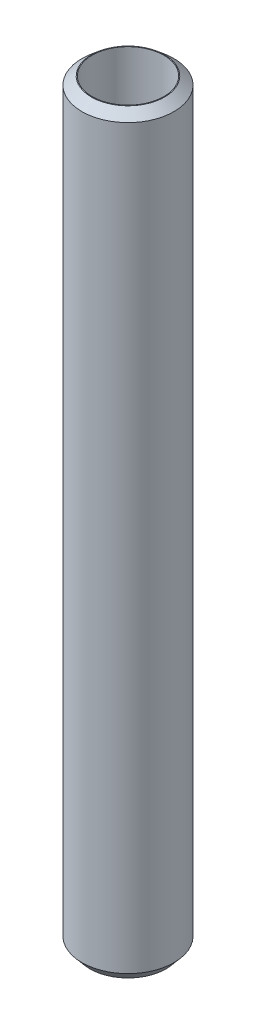
ISO-10303-21;
HEADER;
FILE_DESCRIPTION(('STEP AP214'),'2;1');
FILE_NAME('part.step','',(''),(''),'','','');
FILE_SCHEMA(('AUTOMOTIVE_DESIGN { 1 0 10303 214 1 1 1 1 }'));
ENDSEC;
DATA;
#1=APPLICATION_CONTEXT('core data for automotive mechanical design processes');
#2=APPLICATION_PROTOCOL_DEFINITION('international standard','automotive_design',2000,#1);
#3=PRODUCT_CONTEXT('',#1,'mechanical');
#4=PRODUCT('Part','Part','',(#3));
#5=PRODUCT_RELATED_PRODUCT_CATEGORY('part','',(#4));
#6=PRODUCT_DEFINITION_FORMATION('','',#4);
#7=PRODUCT_DEFINITION_CONTEXT('part definition',#1,'design');
#8=PRODUCT_DEFINITION('design','',#6,#7);
#9=PRODUCT_DEFINITION_SHAPE('','',#8);
#10=(LENGTH_UNIT() NAMED_UNIT(*) SI_UNIT(.MILLI.,.METRE.));
#11=(NAMED_UNIT(*) PLANE_ANGLE_UNIT() SI_UNIT($,.RADIAN.));
#12=(NAMED_UNIT(*) SI_UNIT($,.STERADIAN.) SOLID_ANGLE_UNIT());
#13=UNCERTAINTY_MEASURE_WITH_UNIT(LENGTH_MEASURE(1.E-05),#10,'distance_accuracy_value','');
#14=(GEOMETRIC_REPRESENTATION_CONTEXT(3) GLOBAL_UNCERTAINTY_ASSIGNED_CONTEXT((#13)) GLOBAL_UNIT_ASSIGNED_CONTEXT((#10,
#11,#12)) REPRESENTATION_CONTEXT('',''));
#15=CARTESIAN_POINT('',(0.,0.,0.));
#16=DIRECTION('',(0.,0.,1.));
#17=DIRECTION('',(1.,0.,0.));
#18=AXIS2_PLACEMENT_3D('',#15,#16,#17);
#19=CARTESIAN_POINT('',(0.,491.772621860279,0.));
#20=DIRECTION('',(0.,-1.,0.));
#21=DIRECTION('',(0.,0.,-1.));
#22=AXIS2_PLACEMENT_3D('',#19,#20,#21);
#23=CYLINDRICAL_SURFACE('',#22,30.);
#24=CARTESIAN_POINT('',(0.,486.602276129067,0.));
#25=DIRECTION('',(0.,1.,0.));
#26=DIRECTION('',(0.,0.,1.));
#27=AXIS2_PLACEMENT_3D('',#24,#25,#26);
#28=CIRCLE('',#27,30.);
#29=CARTESIAN_POINT('',(0.,486.602276129067,30.));
#30=VERTEX_POINT('',#29);
#31=EDGE_CURVE('E50',#30,#30,#28,.F.);
#32=ORIENTED_EDGE('',*,*,#31,.T.);
#33=EDGE_LOOP('',(#32));
#34=FACE_BOUND('',#33,.T.);
#35=CARTESIAN_POINT('',(0.,6.11550120719406,0.));
#36=DIRECTION('',(0.,1.,0.));
#37=DIRECTION('',(0.,0.,1.));
#38=AXIS2_PLACEMENT_3D('',#35,#36,#37);
#39=CIRCLE('',#38,30.);
#40=CARTESIAN_POINT('',(0.,6.11550120719406,30.));
#41=VERTEX_POINT('',#40);
#42=EDGE_CURVE('E51',#41,#41,#39,.T.);
#43=ORIENTED_EDGE('',*,*,#42,.T.);
#44=EDGE_LOOP('',(#43));
#45=FACE_BOUND('',#44,.T.);
#46=ADVANCED_FACE('F39',(#34,#45),#23,.T.);
#47=CARTESIAN_POINT('',(0.,491.772621860279,0.));
#48=DIRECTION('',(0.,1.,0.));
#49=DIRECTION('',(0.,0.,1.));
#50=AXIS2_PLACEMENT_3D('',#47,#48,#49);
#51=PLANE('',#50);
#52=CARTESIAN_POINT('',(0.,491.772621860279,0.));
#53=DIRECTION('',(0.,1.,0.));
#54=DIRECTION('',(0.,0.,1.));
#55=AXIS2_PLACEMENT_3D('',#52,#53,#54);
#56=CIRCLE('',#55,23.8844987928059);
#57=CARTESIAN_POINT('',(0.,491.772621860279,23.8844987928059));
#58=VERTEX_POINT('',#57);
#59=EDGE_CURVE('E54',#58,#58,#56,.T.);
#60=ORIENTED_EDGE('',*,*,#59,.T.);
#61=EDGE_LOOP('',(#60));
#62=FACE_BOUND('',#61,.T.);
#63=CARTESIAN_POINT('',(0.,491.772621860279,0.));
#64=DIRECTION('',(0.,1.,0.));
#65=DIRECTION('',(0.,0.,1.));
#66=AXIS2_PLACEMENT_3D('',#63,#64,#65);
#67=CIRCLE('',#66,23.3750565938619);
#68=CARTESIAN_POINT('',(0.,491.772621860279,23.3750565938619));
#69=VERTEX_POINT('',#68);
#70=EDGE_CURVE('E58',#69,#69,#67,.T.);
#71=ORIENTED_EDGE('',*,*,#70,.F.);
#72=EDGE_LOOP('',(#71));
#73=FACE_BOUND('',#72,.T.);
#74=ADVANCED_FACE('F69',(#62,#73),#51,.T.);
#75=CARTESIAN_POINT('',(0.,0.,0.));
#76=DIRECTION('',(0.,1.,0.));
#77=DIRECTION('',(0.,0.,1.));
#78=AXIS2_PLACEMENT_3D('',#75,#76,#77);
#79=PLANE('',#78);
#80=CARTESIAN_POINT('',(0.,0.,0.));
#81=DIRECTION('',(0.,1.,0.));
#82=DIRECTION('',(0.,0.,1.));
#83=AXIS2_PLACEMENT_3D('',#80,#81,#82);
#84=CIRCLE('',#83,24.8296542687883);
#85=CARTESIAN_POINT('',(0.,0.,24.8296542687883));
#86=VERTEX_POINT('',#85);
#87=EDGE_CURVE('E10',#86,#86,#84,.F.);
#88=ORIENTED_EDGE('',*,*,#87,.T.);
#89=EDGE_LOOP('',(#88));
#90=FACE_BOUND('',#89,.T.);
#91=CARTESIAN_POINT('',(0.,0.,0.));
#92=DIRECTION('',(0.,1.,0.));
#93=DIRECTION('',(0.,0.,1.));
#94=AXIS2_PLACEMENT_3D('',#91,#92,#93);
#95=CIRCLE('',#94,23.3750565938619);
#96=CARTESIAN_POINT('',(0.,0.,23.3750565938619));
#97=VERTEX_POINT('',#96);
#98=EDGE_CURVE('E63',#97,#97,#95,.T.);
#99=ORIENTED_EDGE('',*,*,#98,.T.);
#100=EDGE_LOOP('',(#99));
#101=FACE_BOUND('',#100,.T.);
#102=ADVANCED_FACE('F75',(#90,#101),#79,.F.);
#103=CARTESIAN_POINT('',(0.,491.772621860279,0.));
#104=DIRECTION('',(0.,-1.,0.));
#105=DIRECTION('',(0.,0.,-1.));
#106=AXIS2_PLACEMENT_3D('',#103,#104,#105);
#107=CYLINDRICAL_SURFACE('',#106,23.3750565938619);
#108=ORIENTED_EDGE('',*,*,#70,.T.);
#109=EDGE_LOOP('',(#108));
#110=FACE_BOUND('',#109,.T.);
#111=ORIENTED_EDGE('',*,*,#98,.F.);
#112=EDGE_LOOP('',(#111));
#113=FACE_BOUND('',#112,.T.);
#114=ADVANCED_FACE('F70',(#110,#113),#107,.F.);
#115=CARTESIAN_POINT('',(0.,491.772621860279,0.));
#116=DIRECTION('',(0.,-1.,0.));
#117=DIRECTION('',(0.,0.,-1.));
#118=AXIS2_PLACEMENT_3D('',#115,#116,#117);
#119=CONICAL_SURFACE('',#118,23.8844987928059,0.868950164410034);
#120=ORIENTED_EDGE('',*,*,#31,.F.);
#121=EDGE_LOOP('',(#120));
#122=FACE_BOUND('',#121,.T.);
#123=ORIENTED_EDGE('',*,*,#59,.F.);
#124=EDGE_LOOP('',(#123));
#125=FACE_BOUND('',#124,.T.);
#126=ADVANCED_FACE('F81',(#122,#125),#119,.T.);
#127=CARTESIAN_POINT('',(0.,6.11550120719406,0.));
#128=DIRECTION('',(0.,1.,0.));
#129=DIRECTION('',(0.,0.,1.));
#130=AXIS2_PLACEMENT_3D('',#127,#128,#129);
#131=CONICAL_SURFACE('',#130,30.,0.701846162384866);
#132=ORIENTED_EDGE('',*,*,#87,.F.);
#133=EDGE_LOOP('',(#132));
#134=FACE_BOUND('',#133,.T.);
#135=ORIENTED_EDGE('',*,*,#42,.F.);
#136=EDGE_LOOP('',(#135));
#137=FACE_BOUND('',#136,.T.);
#138=ADVANCED_FACE('F45',(#134,#137),#131,.T.);
#139=CLOSED_SHELL('',(#46,#74,#102,#114,#126,#138));
#140=MANIFOLD_SOLID_BREP('B2',#139);
#141=ADVANCED_BREP_SHAPE_REPRESENTATION('',(#18,#140),#14);
#142=SHAPE_DEFINITION_REPRESENTATION(#9,#141);
ENDSEC;
END-ISO-10303-21;
